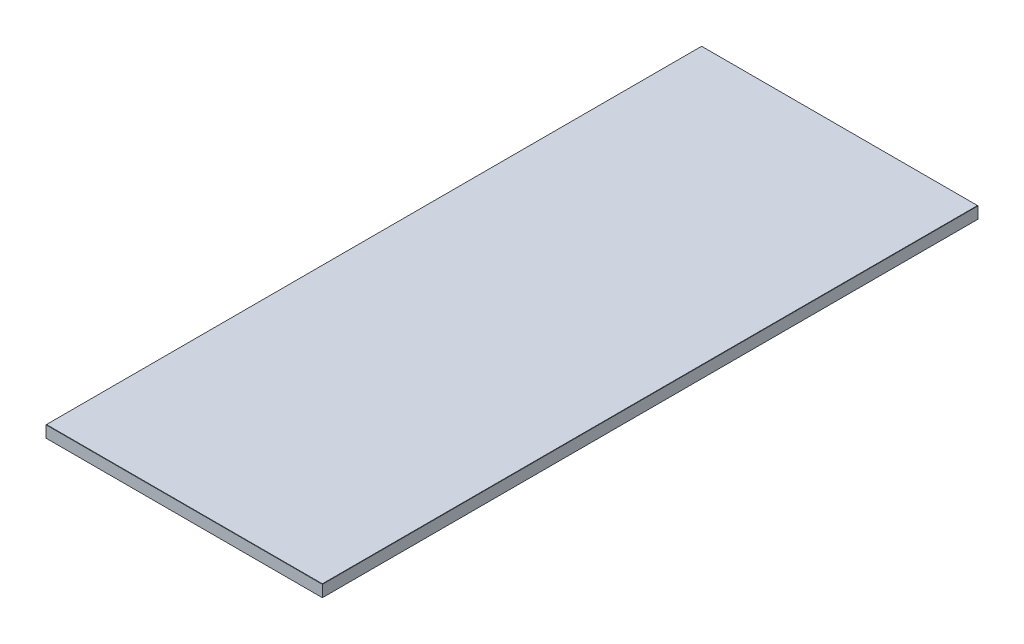
ISO-10303-21;
HEADER;
FILE_DESCRIPTION(('STEP AP214'),'2;1');
FILE_NAME('part.step','',(''),(''),'','','');
FILE_SCHEMA(('AUTOMOTIVE_DESIGN { 1 0 10303 214 1 1 1 1 }'));
ENDSEC;
DATA;
#1=APPLICATION_CONTEXT('core data for automotive mechanical design processes');
#2=APPLICATION_PROTOCOL_DEFINITION('international standard','automotive_design',2000,#1);
#3=PRODUCT_CONTEXT('',#1,'mechanical');
#4=PRODUCT('Part','Part','',(#3));
#5=PRODUCT_RELATED_PRODUCT_CATEGORY('part','',(#4));
#6=PRODUCT_DEFINITION_FORMATION('','',#4);
#7=PRODUCT_DEFINITION_CONTEXT('part definition',#1,'design');
#8=PRODUCT_DEFINITION('design','',#6,#7);
#9=PRODUCT_DEFINITION_SHAPE('','',#8);
#10=(LENGTH_UNIT() NAMED_UNIT(*) SI_UNIT(.MILLI.,.METRE.));
#11=(NAMED_UNIT(*) PLANE_ANGLE_UNIT() SI_UNIT($,.RADIAN.));
#12=(NAMED_UNIT(*) SI_UNIT($,.STERADIAN.) SOLID_ANGLE_UNIT());
#13=UNCERTAINTY_MEASURE_WITH_UNIT(LENGTH_MEASURE(1.E-05),#10,'distance_accuracy_value','');
#14=(GEOMETRIC_REPRESENTATION_CONTEXT(3) GLOBAL_UNCERTAINTY_ASSIGNED_CONTEXT((#13)) GLOBAL_UNIT_ASSIGNED_CONTEXT((#10,
#11,#12)) REPRESENTATION_CONTEXT('',''));
#15=CARTESIAN_POINT('',(0.,0.,0.));
#16=DIRECTION('',(0.,0.,1.));
#17=DIRECTION('',(1.,0.,0.));
#18=AXIS2_PLACEMENT_3D('',#15,#16,#17);
#19=CARTESIAN_POINT('',(137.,12.,325.));
#20=DIRECTION('',(-1.,0.,0.));
#21=DIRECTION('',(0.,0.,1.));
#22=AXIS2_PLACEMENT_3D('',#19,#20,#21);
#23=PLANE('',#22);
#24=DIRECTION('',(0.,-1.,0.));
#25=VECTOR('',#24,1.);
#26=CARTESIAN_POINT('',(137.,12.,325.));
#27=LINE('',#26,#25);
#28=CARTESIAN_POINT('',(137.,11.75,325.));
#29=VERTEX_POINT('',#28);
#30=CARTESIAN_POINT('',(137.,0.249999999999917,325.));
#31=VERTEX_POINT('',#30);
#32=EDGE_CURVE('E142',#29,#31,#27,.T.);
#33=ORIENTED_EDGE('',*,*,#32,.T.);
#34=DIRECTION('',(0.,0.,-1.));
#35=VECTOR('',#34,1.);
#36=CARTESIAN_POINT('',(137.,0.249999999999917,-325.));
#37=LINE('',#36,#35);
#38=CARTESIAN_POINT('',(137.,0.249999999999917,-325.));
#39=VERTEX_POINT('',#38);
#40=EDGE_CURVE('E151',#31,#39,#37,.T.);
#41=ORIENTED_EDGE('',*,*,#40,.T.);
#42=DIRECTION('',(0.,-1.,0.));
#43=VECTOR('',#42,1.);
#44=CARTESIAN_POINT('',(137.,12.,-325.));
#45=LINE('',#44,#43);
#46=CARTESIAN_POINT('',(137.,11.75,-325.));
#47=VERTEX_POINT('',#46);
#48=EDGE_CURVE('E120',#47,#39,#45,.T.);
#49=ORIENTED_EDGE('',*,*,#48,.F.);
#50=DIRECTION('',(0.,0.,1.));
#51=VECTOR('',#50,1.);
#52=CARTESIAN_POINT('',(137.,11.75,325.));
#53=LINE('',#52,#51);
#54=EDGE_CURVE('E153',#47,#29,#53,.T.);
#55=ORIENTED_EDGE('',*,*,#54,.T.);
#56=EDGE_LOOP('',(#33,#41,#49,#55));
#57=FACE_BOUND('',#56,.T.);
#58=ADVANCED_FACE('F33',(#57),#23,.F.);
#59=CARTESIAN_POINT('',(-137.,12.,-325.));
#60=DIRECTION('',(0.,0.,1.));
#61=DIRECTION('',(1.,0.,0.));
#62=AXIS2_PLACEMENT_3D('',#59,#60,#61);
#63=PLANE('',#62);
#64=ORIENTED_EDGE('',*,*,#48,.T.);
#65=DIRECTION('',(-1.,0.,0.));
#66=VECTOR('',#65,1.);
#67=CARTESIAN_POINT('',(-137.,0.249999999999917,-325.));
#68=LINE('',#67,#66);
#69=CARTESIAN_POINT('',(-137.,0.249999999999917,-325.));
#70=VERTEX_POINT('',#69);
#71=EDGE_CURVE('E119',#39,#70,#68,.T.);
#72=ORIENTED_EDGE('',*,*,#71,.T.);
#73=DIRECTION('',(0.,-1.,0.));
#74=VECTOR('',#73,1.);
#75=CARTESIAN_POINT('',(-137.,12.,-325.));
#76=LINE('',#75,#74);
#77=CARTESIAN_POINT('',(-137.,11.75,-325.));
#78=VERTEX_POINT('',#77);
#79=EDGE_CURVE('E102',#78,#70,#76,.T.);
#80=ORIENTED_EDGE('',*,*,#79,.F.);
#81=DIRECTION('',(1.,0.,0.));
#82=VECTOR('',#81,1.);
#83=CARTESIAN_POINT('',(-137.,11.75,-325.));
#84=LINE('',#83,#82);
#85=EDGE_CURVE('E116',#78,#47,#84,.T.);
#86=ORIENTED_EDGE('',*,*,#85,.T.);
#87=EDGE_LOOP('',(#64,#72,#80,#86));
#88=FACE_BOUND('',#87,.T.);
#89=ADVANCED_FACE('F115',(#88),#63,.F.);
#90=CARTESIAN_POINT('',(-137.,12.,325.));
#91=DIRECTION('',(1.,0.,0.));
#92=DIRECTION('',(0.,0.,-1.));
#93=AXIS2_PLACEMENT_3D('',#90,#91,#92);
#94=PLANE('',#93);
#95=ORIENTED_EDGE('',*,*,#79,.T.);
#96=DIRECTION('',(0.,0.,1.));
#97=VECTOR('',#96,1.);
#98=CARTESIAN_POINT('',(-137.,0.249999999999917,325.));
#99=LINE('',#98,#97);
#100=CARTESIAN_POINT('',(-137.,0.249999999999917,325.));
#101=VERTEX_POINT('',#100);
#102=EDGE_CURVE('E108',#70,#101,#99,.T.);
#103=ORIENTED_EDGE('',*,*,#102,.T.);
#104=DIRECTION('',(0.,-1.,0.));
#105=VECTOR('',#104,1.);
#106=CARTESIAN_POINT('',(-137.,12.,325.));
#107=LINE('',#106,#105);
#108=CARTESIAN_POINT('',(-137.,11.75,325.));
#109=VERTEX_POINT('',#108);
#110=EDGE_CURVE('E104',#109,#101,#107,.T.);
#111=ORIENTED_EDGE('',*,*,#110,.F.);
#112=DIRECTION('',(0.,0.,-1.));
#113=VECTOR('',#112,1.);
#114=CARTESIAN_POINT('',(-137.,11.75,325.));
#115=LINE('',#114,#113);
#116=EDGE_CURVE('E99',#109,#78,#115,.T.);
#117=ORIENTED_EDGE('',*,*,#116,.T.);
#118=EDGE_LOOP('',(#95,#103,#111,#117));
#119=FACE_BOUND('',#118,.T.);
#120=ADVANCED_FACE('F101',(#119),#94,.F.);
#121=CARTESIAN_POINT('',(-137.,12.,325.));
#122=DIRECTION('',(0.,0.,-1.));
#123=DIRECTION('',(-1.,0.,0.));
#124=AXIS2_PLACEMENT_3D('',#121,#122,#123);
#125=PLANE('',#124);
#126=ORIENTED_EDGE('',*,*,#110,.T.);
#127=DIRECTION('',(1.,0.,0.));
#128=VECTOR('',#127,1.);
#129=CARTESIAN_POINT('',(137.,0.249999999999917,325.));
#130=LINE('',#129,#128);
#131=EDGE_CURVE('E155',#101,#31,#130,.T.);
#132=ORIENTED_EDGE('',*,*,#131,.T.);
#133=ORIENTED_EDGE('',*,*,#32,.F.);
#134=DIRECTION('',(-1.,0.,0.));
#135=VECTOR('',#134,1.);
#136=CARTESIAN_POINT('',(-137.,11.75,325.));
#137=LINE('',#136,#135);
#138=EDGE_CURVE('E157',#29,#109,#137,.T.);
#139=ORIENTED_EDGE('',*,*,#138,.T.);
#140=EDGE_LOOP('',(#126,#132,#133,#139));
#141=FACE_BOUND('',#140,.T.);
#142=ADVANCED_FACE('F195',(#141),#125,.F.);
#143=CARTESIAN_POINT('',(0.,12.,0.));
#144=DIRECTION('',(0.,-1.,0.));
#145=DIRECTION('',(0.,0.,-1.));
#146=AXIS2_PLACEMENT_3D('',#143,#144,#145);
#147=PLANE('',#146);
#148=DIRECTION('',(0.,0.,1.));
#149=VECTOR('',#148,1.);
#150=CARTESIAN_POINT('',(-136.75,12.,0.));
#151=LINE('',#150,#149);
#152=CARTESIAN_POINT('',(-136.75,12.,-324.75));
#153=VERTEX_POINT('',#152);
#154=CARTESIAN_POINT('',(-136.75,12.,324.75));
#155=VERTEX_POINT('',#154);
#156=EDGE_CURVE('E42',#153,#155,#151,.T.);
#157=ORIENTED_EDGE('',*,*,#156,.T.);
#158=DIRECTION('',(1.,0.,0.));
#159=VECTOR('',#158,1.);
#160=CARTESIAN_POINT('',(0.,12.,324.75));
#161=LINE('',#160,#159);
#162=CARTESIAN_POINT('',(136.75,12.,324.75));
#163=VERTEX_POINT('',#162);
#164=EDGE_CURVE('E11',#155,#163,#161,.T.);
#165=ORIENTED_EDGE('',*,*,#164,.T.);
#166=DIRECTION('',(0.,0.,-1.));
#167=VECTOR('',#166,1.);
#168=CARTESIAN_POINT('',(136.75,12.,0.));
#169=LINE('',#168,#167);
#170=CARTESIAN_POINT('',(136.75,12.,-324.75));
#171=VERTEX_POINT('',#170);
#172=EDGE_CURVE('E149',#163,#171,#169,.T.);
#173=ORIENTED_EDGE('',*,*,#172,.T.);
#174=DIRECTION('',(-1.,0.,0.));
#175=VECTOR('',#174,1.);
#176=CARTESIAN_POINT('',(0.,12.,-324.75));
#177=LINE('',#176,#175);
#178=EDGE_CURVE('E53',#171,#153,#177,.T.);
#179=ORIENTED_EDGE('',*,*,#178,.T.);
#180=EDGE_LOOP('',(#157,#165,#173,#179));
#181=FACE_BOUND('',#180,.T.);
#182=ADVANCED_FACE('F201',(#181),#147,.F.);
#183=CARTESIAN_POINT('',(0.,0.,0.));
#184=DIRECTION('',(0.,-1.,0.));
#185=DIRECTION('',(0.,0.,-1.));
#186=AXIS2_PLACEMENT_3D('',#183,#184,#185);
#187=PLANE('',#186);
#188=DIRECTION('',(0.,0.,-1.));
#189=VECTOR('',#188,1.);
#190=CARTESIAN_POINT('',(-136.75,0.,-325.));
#191=LINE('',#190,#189);
#192=CARTESIAN_POINT('',(-136.75,0.,324.75));
#193=VERTEX_POINT('',#192);
#194=CARTESIAN_POINT('',(-136.75,0.,-324.75));
#195=VERTEX_POINT('',#194);
#196=EDGE_CURVE('E162',#193,#195,#191,.T.);
#197=ORIENTED_EDGE('',*,*,#196,.T.);
#198=DIRECTION('',(1.,0.,0.));
#199=VECTOR('',#198,1.);
#200=CARTESIAN_POINT('',(137.,0.,-324.75));
#201=LINE('',#200,#199);
#202=CARTESIAN_POINT('',(136.75,0.,-324.75));
#203=VERTEX_POINT('',#202);
#204=EDGE_CURVE('E109',#195,#203,#201,.T.);
#205=ORIENTED_EDGE('',*,*,#204,.T.);
#206=DIRECTION('',(0.,0.,1.));
#207=VECTOR('',#206,1.);
#208=CARTESIAN_POINT('',(136.75,0.,325.));
#209=LINE('',#208,#207);
#210=CARTESIAN_POINT('',(136.75,0.,324.75));
#211=VERTEX_POINT('',#210);
#212=EDGE_CURVE('E166',#203,#211,#209,.T.);
#213=ORIENTED_EDGE('',*,*,#212,.T.);
#214=DIRECTION('',(-1.,0.,0.));
#215=VECTOR('',#214,1.);
#216=CARTESIAN_POINT('',(-137.,0.,324.75));
#217=LINE('',#216,#215);
#218=EDGE_CURVE('E164',#211,#193,#217,.T.);
#219=ORIENTED_EDGE('',*,*,#218,.T.);
#220=EDGE_LOOP('',(#197,#205,#213,#219));
#221=FACE_BOUND('',#220,.T.);
#222=ADVANCED_FACE('F203',(#221),#187,.T.);
#223=CARTESIAN_POINT('',(-137.,0.249999999999917,325.));
#224=DIRECTION('',(0.,-0.707106781186626,0.707106781186469));
#225=DIRECTION('',(-1.,0.,0.));
#226=AXIS2_PLACEMENT_3D('',#223,#224,#225);
#227=PLANE('',#226);
#228=DIRECTION('',(0.577350269189668,-0.57735026918954,-0.577350269189668));
#229=VECTOR('',#228,1.);
#230=CARTESIAN_POINT('',(-137.,0.249999999999917,325.));
#231=LINE('',#230,#229);
#232=EDGE_CURVE('E143',#193,#101,#231,.F.);
#233=ORIENTED_EDGE('',*,*,#232,.F.);
#234=ORIENTED_EDGE('',*,*,#218,.F.);
#235=DIRECTION('',(-0.577350269189668,-0.57735026918954,-0.577350269189668));
#236=VECTOR('',#235,1.);
#237=CARTESIAN_POINT('',(137.,0.249999999999917,325.));
#238=LINE('',#237,#236);
#239=EDGE_CURVE('E139',#31,#211,#238,.T.);
#240=ORIENTED_EDGE('',*,*,#239,.F.);
#241=ORIENTED_EDGE('',*,*,#131,.F.);
#242=EDGE_LOOP('',(#233,#234,#240,#241));
#243=FACE_BOUND('',#242,.T.);
#244=ADVANCED_FACE('F182',(#243),#227,.T.);
#245=CARTESIAN_POINT('',(137.,0.249999999999917,325.));
#246=DIRECTION('',(0.707106781186469,-0.707106781186626,0.));
#247=DIRECTION('',(0.,0.,1.));
#248=AXIS2_PLACEMENT_3D('',#245,#246,#247);
#249=PLANE('',#248);
#250=ORIENTED_EDGE('',*,*,#239,.T.);
#251=ORIENTED_EDGE('',*,*,#212,.F.);
#252=DIRECTION('',(0.577350269189668,0.57735026918954,-0.577350269189668));
#253=VECTOR('',#252,1.);
#254=CARTESIAN_POINT('',(-79.6666666666987,-216.416666666651,-108.333333333301));
#255=LINE('',#254,#253);
#256=EDGE_CURVE('E130',#39,#203,#255,.F.);
#257=ORIENTED_EDGE('',*,*,#256,.F.);
#258=ORIENTED_EDGE('',*,*,#40,.F.);
#259=EDGE_LOOP('',(#250,#251,#257,#258));
#260=FACE_BOUND('',#259,.T.);
#261=ADVANCED_FACE('F186',(#260),#249,.T.);
#262=CARTESIAN_POINT('',(-137.,0.249999999999917,325.));
#263=DIRECTION('',(-0.707106781186469,-0.707106781186626,0.));
#264=DIRECTION('',(0.,0.,-1.));
#265=AXIS2_PLACEMENT_3D('',#262,#263,#264);
#266=PLANE('',#265);
#267=ORIENTED_EDGE('',*,*,#232,.T.);
#268=ORIENTED_EDGE('',*,*,#102,.F.);
#269=DIRECTION('',(0.577350269189668,-0.57735026918954,0.577350269189668));
#270=VECTOR('',#269,1.);
#271=CARTESIAN_POINT('',(79.6666666666987,-216.416666666651,-108.333333333301));
#272=LINE('',#271,#270);
#273=EDGE_CURVE('E129',#195,#70,#272,.F.);
#274=ORIENTED_EDGE('',*,*,#273,.F.);
#275=ORIENTED_EDGE('',*,*,#196,.F.);
#276=EDGE_LOOP('',(#267,#268,#274,#275));
#277=FACE_BOUND('',#276,.T.);
#278=ADVANCED_FACE('F194',(#277),#266,.T.);
#279=CARTESIAN_POINT('',(-137.,0.249999999999917,-325.));
#280=DIRECTION('',(0.,-0.707106781186626,-0.707106781186469));
#281=DIRECTION('',(1.,0.,0.));
#282=AXIS2_PLACEMENT_3D('',#279,#280,#281);
#283=PLANE('',#282);
#284=ORIENTED_EDGE('',*,*,#256,.T.);
#285=ORIENTED_EDGE('',*,*,#204,.F.);
#286=ORIENTED_EDGE('',*,*,#273,.T.);
#287=ORIENTED_EDGE('',*,*,#71,.F.);
#288=EDGE_LOOP('',(#284,#285,#286,#287));
#289=FACE_BOUND('',#288,.T.);
#290=ADVANCED_FACE('F189',(#289),#283,.T.);
#291=CARTESIAN_POINT('',(0.,12.,-324.75));
#292=DIRECTION('',(0.,-0.707106781186548,0.707106781186548));
#293=DIRECTION('',(-1.,0.,0.));
#294=AXIS2_PLACEMENT_3D('',#291,#292,#293);
#295=PLANE('',#294);
#296=DIRECTION('',(-0.577350269189626,0.577350269189626,0.577350269189626));
#297=VECTOR('',#296,1.);
#298=CARTESIAN_POINT('',(28.5,120.25,-216.5));
#299=LINE('',#298,#297);
#300=EDGE_CURVE('E125',#47,#171,#299,.T.);
#301=ORIENTED_EDGE('',*,*,#300,.F.);
#302=ORIENTED_EDGE('',*,*,#85,.F.);
#303=DIRECTION('',(0.577350269189626,0.577350269189626,0.577350269189626));
#304=VECTOR('',#303,1.);
#305=CARTESIAN_POINT('',(-91.1666666666667,57.5833333333333,-279.166666666667));
#306=LINE('',#305,#304);
#307=EDGE_CURVE('E37',#153,#78,#306,.F.);
#308=ORIENTED_EDGE('',*,*,#307,.F.);
#309=ORIENTED_EDGE('',*,*,#178,.F.);
#310=EDGE_LOOP('',(#301,#302,#308,#309));
#311=FACE_BOUND('',#310,.T.);
#312=ADVANCED_FACE('F35',(#311),#295,.F.);
#313=CARTESIAN_POINT('',(-136.75,12.,0.));
#314=DIRECTION('',(0.707106781186548,-0.707106781186548,0.));
#315=DIRECTION('',(0.,0.,1.));
#316=AXIS2_PLACEMENT_3D('',#313,#314,#315);
#317=PLANE('',#316);
#318=ORIENTED_EDGE('',*,*,#307,.T.);
#319=ORIENTED_EDGE('',*,*,#116,.F.);
#320=DIRECTION('',(0.577350269189626,0.577350269189626,-0.577350269189626));
#321=VECTOR('',#320,1.);
#322=CARTESIAN_POINT('',(-28.5,120.25,216.5));
#323=LINE('',#322,#321);
#324=EDGE_CURVE('E132',#155,#109,#323,.F.);
#325=ORIENTED_EDGE('',*,*,#324,.F.);
#326=ORIENTED_EDGE('',*,*,#156,.F.);
#327=EDGE_LOOP('',(#318,#319,#325,#326));
#328=FACE_BOUND('',#327,.T.);
#329=ADVANCED_FACE('F128',(#328),#317,.F.);
#330=CARTESIAN_POINT('',(136.75,12.,0.));
#331=DIRECTION('',(-0.707106781186548,-0.707106781186548,0.));
#332=DIRECTION('',(0.,0.,-1.));
#333=AXIS2_PLACEMENT_3D('',#330,#331,#332);
#334=PLANE('',#333);
#335=ORIENTED_EDGE('',*,*,#300,.T.);
#336=ORIENTED_EDGE('',*,*,#172,.F.);
#337=DIRECTION('',(0.577350269189626,-0.577350269189626,0.577350269189626));
#338=VECTOR('',#337,1.);
#339=CARTESIAN_POINT('',(28.5,120.25,216.5));
#340=LINE('',#339,#338);
#341=EDGE_CURVE('E135',#29,#163,#340,.F.);
#342=ORIENTED_EDGE('',*,*,#341,.F.);
#343=ORIENTED_EDGE('',*,*,#54,.F.);
#344=EDGE_LOOP('',(#335,#336,#342,#343));
#345=FACE_BOUND('',#344,.T.);
#346=ADVANCED_FACE('F200',(#345),#334,.F.);
#347=CARTESIAN_POINT('',(0.,12.,324.75));
#348=DIRECTION('',(0.,-0.707106781186548,-0.707106781186548));
#349=DIRECTION('',(1.,0.,0.));
#350=AXIS2_PLACEMENT_3D('',#347,#348,#349);
#351=PLANE('',#350);
#352=ORIENTED_EDGE('',*,*,#324,.T.);
#353=ORIENTED_EDGE('',*,*,#138,.F.);
#354=ORIENTED_EDGE('',*,*,#341,.T.);
#355=ORIENTED_EDGE('',*,*,#164,.F.);
#356=EDGE_LOOP('',(#352,#353,#354,#355));
#357=FACE_BOUND('',#356,.T.);
#358=ADVANCED_FACE('F198',(#357),#351,.F.);
#359=CLOSED_SHELL('',(#58,#89,#120,#142,#182,#222,#244,#261,#278,#290,#312,#329,#346,#358));
#360=MANIFOLD_SOLID_BREP('B2',#359);
#361=ADVANCED_BREP_SHAPE_REPRESENTATION('',(#18,#360),#14);
#362=SHAPE_DEFINITION_REPRESENTATION(#9,#361);
ENDSEC;
END-ISO-10303-21;
